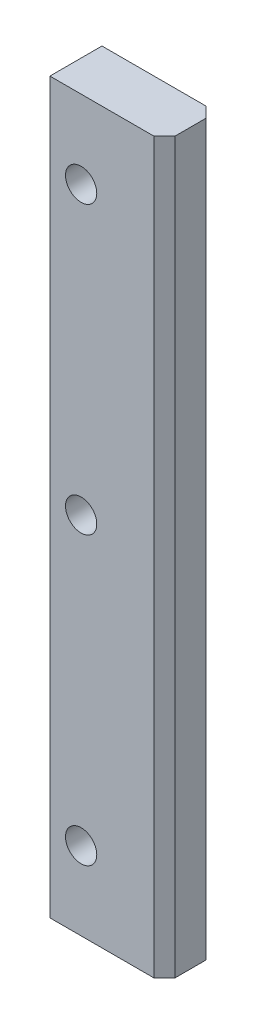
ISO-10303-21;
HEADER;
FILE_DESCRIPTION(('STEP AP214'),'2;1');
FILE_NAME('part.step','',(''),(''),'','','');
FILE_SCHEMA(('AUTOMOTIVE_DESIGN { 1 0 10303 214 1 1 1 1 }'));
ENDSEC;
DATA;
#1=APPLICATION_CONTEXT('core data for automotive mechanical design processes');
#2=APPLICATION_PROTOCOL_DEFINITION('international standard','automotive_design',2000,#1);
#3=PRODUCT_CONTEXT('',#1,'mechanical');
#4=PRODUCT('Part','Part','',(#3));
#5=PRODUCT_RELATED_PRODUCT_CATEGORY('part','',(#4));
#6=PRODUCT_DEFINITION_FORMATION('','',#4);
#7=PRODUCT_DEFINITION_CONTEXT('part definition',#1,'design');
#8=PRODUCT_DEFINITION('design','',#6,#7);
#9=PRODUCT_DEFINITION_SHAPE('','',#8);
#10=(LENGTH_UNIT() NAMED_UNIT(*) SI_UNIT(.MILLI.,.METRE.));
#11=(NAMED_UNIT(*) PLANE_ANGLE_UNIT() SI_UNIT($,.RADIAN.));
#12=(NAMED_UNIT(*) SI_UNIT($,.STERADIAN.) SOLID_ANGLE_UNIT());
#13=UNCERTAINTY_MEASURE_WITH_UNIT(LENGTH_MEASURE(1.E-05),#10,'distance_accuracy_value','');
#14=(GEOMETRIC_REPRESENTATION_CONTEXT(3) GLOBAL_UNCERTAINTY_ASSIGNED_CONTEXT((#13)) GLOBAL_UNIT_ASSIGNED_CONTEXT((#10,
#11,#12)) REPRESENTATION_CONTEXT('',''));
#15=CARTESIAN_POINT('',(0.,0.,0.));
#16=DIRECTION('',(0.,0.,1.));
#17=DIRECTION('',(1.,0.,0.));
#18=AXIS2_PLACEMENT_3D('',#15,#16,#17);
#19=CARTESIAN_POINT('',(11.,-70.,10.));
#20=DIRECTION('',(0.,1.,0.));
#21=DIRECTION('',(0.,0.,1.));
#22=AXIS2_PLACEMENT_3D('',#19,#20,#21);
#23=PLANE('',#22);
#24=DIRECTION('',(0.,0.,-1.));
#25=VECTOR('',#24,1.);
#26=CARTESIAN_POINT('',(11.,-70.,10.));
#27=LINE('',#26,#25);
#28=CARTESIAN_POINT('',(11.,-70.,8.00000000000001));
#29=VERTEX_POINT('',#28);
#30=CARTESIAN_POINT('',(11.,-70.,2.00000000000002));
#31=VERTEX_POINT('',#30);
#32=EDGE_CURVE('E131',#29,#31,#27,.T.);
#33=ORIENTED_EDGE('',*,*,#32,.F.);
#34=DIRECTION('',(0.707106781186548,0.,-0.707106781186548));
#35=VECTOR('',#34,1.);
#36=CARTESIAN_POINT('',(9.00000000000005,-70.,10.));
#37=LINE('',#36,#35);
#38=CARTESIAN_POINT('',(9.00000000000006,-70.,10.));
#39=VERTEX_POINT('',#38);
#40=EDGE_CURVE('E49',#29,#39,#37,.F.);
#41=ORIENTED_EDGE('',*,*,#40,.T.);
#42=DIRECTION('',(1.,0.,0.));
#43=VECTOR('',#42,1.);
#44=CARTESIAN_POINT('',(11.,-70.,10.));
#45=LINE('',#44,#43);
#46=CARTESIAN_POINT('',(-11.,-70.,10.));
#47=VERTEX_POINT('',#46);
#48=EDGE_CURVE('E105',#47,#39,#45,.T.);
#49=ORIENTED_EDGE('',*,*,#48,.F.);
#50=DIRECTION('',(0.,0.,-1.));
#51=VECTOR('',#50,1.);
#52=CARTESIAN_POINT('',(-11.,-70.,10.));
#53=LINE('',#52,#51);
#54=CARTESIAN_POINT('',(-11.,-70.,0.));
#55=VERTEX_POINT('',#54);
#56=EDGE_CURVE('E114',#47,#55,#53,.T.);
#57=ORIENTED_EDGE('',*,*,#56,.T.);
#58=DIRECTION('',(1.,0.,0.));
#59=VECTOR('',#58,1.);
#60=CARTESIAN_POINT('',(11.,-70.,0.));
#61=LINE('',#60,#59);
#62=CARTESIAN_POINT('',(9.00000000000003,-70.,0.));
#63=VERTEX_POINT('',#62);
#64=EDGE_CURVE('E123',#55,#63,#61,.T.);
#65=ORIENTED_EDGE('',*,*,#64,.T.);
#66=DIRECTION('',(0.707106781186548,0.,0.707106781186548));
#67=VECTOR('',#66,1.);
#68=CARTESIAN_POINT('',(11.,-70.,2.));
#69=LINE('',#68,#67);
#70=EDGE_CURVE('E61',#63,#31,#69,.T.);
#71=ORIENTED_EDGE('',*,*,#70,.T.);
#72=EDGE_LOOP('',(#33,#41,#49,#57,#65,#71));
#73=FACE_BOUND('',#72,.T.);
#74=ADVANCED_FACE('F40',(#73),#23,.F.);
#75=CARTESIAN_POINT('',(11.,70.,10.));
#76=DIRECTION('',(-1.,0.,0.));
#77=DIRECTION('',(0.,-1.,0.));
#78=AXIS2_PLACEMENT_3D('',#75,#76,#77);
#79=PLANE('',#78);
#80=DIRECTION('',(0.,0.,-1.));
#81=VECTOR('',#80,1.);
#82=CARTESIAN_POINT('',(11.,70.,10.));
#83=LINE('',#82,#81);
#84=CARTESIAN_POINT('',(11.,70.,8.00000000000001));
#85=VERTEX_POINT('',#84);
#86=CARTESIAN_POINT('',(11.,70.,2.00000000000002));
#87=VERTEX_POINT('',#86);
#88=EDGE_CURVE('E113',#85,#87,#83,.T.);
#89=ORIENTED_EDGE('',*,*,#88,.F.);
#90=DIRECTION('',(0.,-1.,0.));
#91=VECTOR('',#90,1.);
#92=CARTESIAN_POINT('',(11.,70.,8.00000000000001));
#93=LINE('',#92,#91);
#94=EDGE_CURVE('E141',#85,#29,#93,.T.);
#95=ORIENTED_EDGE('',*,*,#94,.T.);
#96=ORIENTED_EDGE('',*,*,#32,.T.);
#97=DIRECTION('',(0.,1.,0.));
#98=VECTOR('',#97,1.);
#99=CARTESIAN_POINT('',(11.,70.,2.00000000000002));
#100=LINE('',#99,#98);
#101=EDGE_CURVE('E138',#31,#87,#100,.T.);
#102=ORIENTED_EDGE('',*,*,#101,.T.);
#103=EDGE_LOOP('',(#89,#95,#96,#102));
#104=FACE_BOUND('',#103,.T.);
#105=ADVANCED_FACE('F149',(#104),#79,.F.);
#106=CARTESIAN_POINT('',(-11.,70.,10.));
#107=DIRECTION('',(0.,-1.,0.));
#108=DIRECTION('',(0.,0.,-1.));
#109=AXIS2_PLACEMENT_3D('',#106,#107,#108);
#110=PLANE('',#109);
#111=DIRECTION('',(-1.,0.,0.));
#112=VECTOR('',#111,1.);
#113=CARTESIAN_POINT('',(-11.,70.,10.));
#114=LINE('',#113,#112);
#115=CARTESIAN_POINT('',(9.00000000000002,70.,10.));
#116=VERTEX_POINT('',#115);
#117=CARTESIAN_POINT('',(-11.,70.,10.));
#118=VERTEX_POINT('',#117);
#119=EDGE_CURVE('E95',#116,#118,#114,.T.);
#120=ORIENTED_EDGE('',*,*,#119,.F.);
#121=DIRECTION('',(-0.707106781186548,0.,0.707106781186548));
#122=VECTOR('',#121,1.);
#123=CARTESIAN_POINT('',(9.00000000000003,70.,9.99999999999999));
#124=LINE('',#123,#122);
#125=EDGE_CURVE('E136',#116,#85,#124,.F.);
#126=ORIENTED_EDGE('',*,*,#125,.T.);
#127=ORIENTED_EDGE('',*,*,#88,.T.);
#128=DIRECTION('',(-0.707106781186548,0.,-0.707106781186548));
#129=VECTOR('',#128,1.);
#130=CARTESIAN_POINT('',(11.,70.,2.00000000000002));
#131=LINE('',#130,#129);
#132=CARTESIAN_POINT('',(9.,70.,0.));
#133=VERTEX_POINT('',#132);
#134=EDGE_CURVE('E134',#87,#133,#131,.T.);
#135=ORIENTED_EDGE('',*,*,#134,.T.);
#136=DIRECTION('',(-1.,0.,0.));
#137=VECTOR('',#136,1.);
#138=CARTESIAN_POINT('',(-11.,70.,0.));
#139=LINE('',#138,#137);
#140=CARTESIAN_POINT('',(-11.,70.,0.));
#141=VERTEX_POINT('',#140);
#142=EDGE_CURVE('E110',#133,#141,#139,.T.);
#143=ORIENTED_EDGE('',*,*,#142,.T.);
#144=DIRECTION('',(0.,0.,-1.));
#145=VECTOR('',#144,1.);
#146=CARTESIAN_POINT('',(-11.,70.,10.));
#147=LINE('',#146,#145);
#148=EDGE_CURVE('E108',#118,#141,#147,.T.);
#149=ORIENTED_EDGE('',*,*,#148,.F.);
#150=EDGE_LOOP('',(#120,#126,#127,#135,#143,#149));
#151=FACE_BOUND('',#150,.T.);
#152=ADVANCED_FACE('F109',(#151),#110,.F.);
#153=CARTESIAN_POINT('',(-11.,-70.,10.));
#154=DIRECTION('',(1.,0.,0.));
#155=DIRECTION('',(0.,0.,-1.));
#156=AXIS2_PLACEMENT_3D('',#153,#154,#155);
#157=PLANE('',#156);
#158=DIRECTION('',(0.,-1.,0.));
#159=VECTOR('',#158,1.);
#160=CARTESIAN_POINT('',(-11.,-70.,0.));
#161=LINE('',#160,#159);
#162=EDGE_CURVE('E127',#141,#55,#161,.T.);
#163=ORIENTED_EDGE('',*,*,#162,.T.);
#164=ORIENTED_EDGE('',*,*,#56,.F.);
#165=DIRECTION('',(0.,-1.,0.));
#166=VECTOR('',#165,1.);
#167=CARTESIAN_POINT('',(-11.,-70.,10.));
#168=LINE('',#167,#166);
#169=EDGE_CURVE('E100',#118,#47,#168,.T.);
#170=ORIENTED_EDGE('',*,*,#169,.F.);
#171=ORIENTED_EDGE('',*,*,#148,.T.);
#172=EDGE_LOOP('',(#163,#164,#170,#171));
#173=FACE_BOUND('',#172,.T.);
#174=ADVANCED_FACE('F116',(#173),#157,.F.);
#175=CARTESIAN_POINT('',(0.,0.,10.));
#176=DIRECTION('',(0.,0.,-1.));
#177=DIRECTION('',(-1.,0.,0.));
#178=AXIS2_PLACEMENT_3D('',#175,#176,#177);
#179=PLANE('',#178);
#180=CARTESIAN_POINT('',(-4.99999999999994,55.,10.));
#181=DIRECTION('',(0.,0.,1.));
#182=DIRECTION('',(1.,0.,0.));
#183=AXIS2_PLACEMENT_3D('',#180,#181,#182);
#184=CIRCLE('',#183,3.);
#185=CARTESIAN_POINT('',(-1.99999999999993,55.,10.));
#186=VERTEX_POINT('',#185);
#187=EDGE_CURVE('E235',#186,#186,#184,.T.);
#188=ORIENTED_EDGE('',*,*,#187,.F.);
#189=EDGE_LOOP('',(#188));
#190=FACE_BOUND('',#189,.T.);
#191=CARTESIAN_POINT('',(-4.99999999999993,0.,10.));
#192=DIRECTION('',(0.,0.,1.));
#193=DIRECTION('',(1.,0.,0.));
#194=AXIS2_PLACEMENT_3D('',#191,#192,#193);
#195=CIRCLE('',#194,3.);
#196=CARTESIAN_POINT('',(-1.99999999999993,0.,10.));
#197=VERTEX_POINT('',#196);
#198=EDGE_CURVE('E240',#197,#197,#195,.T.);
#199=ORIENTED_EDGE('',*,*,#198,.F.);
#200=EDGE_LOOP('',(#199));
#201=FACE_BOUND('',#200,.T.);
#202=CARTESIAN_POINT('',(-4.9999999999999,-55.,10.));
#203=DIRECTION('',(0.,0.,1.));
#204=DIRECTION('',(1.,0.,0.));
#205=AXIS2_PLACEMENT_3D('',#202,#203,#204);
#206=CIRCLE('',#205,3.);
#207=CARTESIAN_POINT('',(-1.9999999999999,-55.,10.));
#208=VERTEX_POINT('',#207);
#209=EDGE_CURVE('E248',#208,#208,#206,.T.);
#210=ORIENTED_EDGE('',*,*,#209,.F.);
#211=EDGE_LOOP('',(#210));
#212=FACE_BOUND('',#211,.T.);
#213=ORIENTED_EDGE('',*,*,#48,.T.);
#214=DIRECTION('',(0.,1.,0.));
#215=VECTOR('',#214,1.);
#216=CARTESIAN_POINT('',(9.00000000000004,0.,10.));
#217=LINE('',#216,#215);
#218=EDGE_CURVE('E103',#39,#116,#217,.T.);
#219=ORIENTED_EDGE('',*,*,#218,.T.);
#220=ORIENTED_EDGE('',*,*,#119,.T.);
#221=ORIENTED_EDGE('',*,*,#169,.T.);
#222=EDGE_LOOP('',(#213,#219,#220,#221));
#223=FACE_BOUND('',#222,.T.);
#224=ADVANCED_FACE('F98',(#190,#201,#212,#223),#179,.F.);
#225=CARTESIAN_POINT('',(0.,0.,0.));
#226=DIRECTION('',(0.,0.,-1.));
#227=DIRECTION('',(-1.,0.,0.));
#228=AXIS2_PLACEMENT_3D('',#225,#226,#227);
#229=PLANE('',#228);
#230=CARTESIAN_POINT('',(-4.99999999999994,55.,0.));
#231=DIRECTION('',(0.,0.,1.));
#232=DIRECTION('',(1.,0.,0.));
#233=AXIS2_PLACEMENT_3D('',#230,#231,#232);
#234=CIRCLE('',#233,3.);
#235=CARTESIAN_POINT('',(-1.99999999999993,55.,0.));
#236=VERTEX_POINT('',#235);
#237=EDGE_CURVE('E125',#236,#236,#234,.T.);
#238=ORIENTED_EDGE('',*,*,#237,.T.);
#239=EDGE_LOOP('',(#238));
#240=FACE_BOUND('',#239,.T.);
#241=CARTESIAN_POINT('',(-4.99999999999993,0.,0.));
#242=DIRECTION('',(0.,0.,1.));
#243=DIRECTION('',(1.,0.,0.));
#244=AXIS2_PLACEMENT_3D('',#241,#242,#243);
#245=CIRCLE('',#244,3.);
#246=CARTESIAN_POINT('',(-1.99999999999993,0.,0.));
#247=VERTEX_POINT('',#246);
#248=EDGE_CURVE('E236',#247,#247,#245,.T.);
#249=ORIENTED_EDGE('',*,*,#248,.T.);
#250=EDGE_LOOP('',(#249));
#251=FACE_BOUND('',#250,.T.);
#252=CARTESIAN_POINT('',(-4.9999999999999,-55.,0.));
#253=DIRECTION('',(0.,0.,1.));
#254=DIRECTION('',(1.,0.,0.));
#255=AXIS2_PLACEMENT_3D('',#252,#253,#254);
#256=CIRCLE('',#255,3.);
#257=CARTESIAN_POINT('',(-1.9999999999999,-55.,0.));
#258=VERTEX_POINT('',#257);
#259=EDGE_CURVE('E245',#258,#258,#256,.T.);
#260=ORIENTED_EDGE('',*,*,#259,.T.);
#261=EDGE_LOOP('',(#260));
#262=FACE_BOUND('',#261,.T.);
#263=ORIENTED_EDGE('',*,*,#142,.F.);
#264=DIRECTION('',(0.,-1.,0.));
#265=VECTOR('',#264,1.);
#266=CARTESIAN_POINT('',(9.00000000000003,-70.,0.));
#267=LINE('',#266,#265);
#268=EDGE_CURVE('E11',#133,#63,#267,.T.);
#269=ORIENTED_EDGE('',*,*,#268,.T.);
#270=ORIENTED_EDGE('',*,*,#64,.F.);
#271=ORIENTED_EDGE('',*,*,#162,.F.);
#272=EDGE_LOOP('',(#263,#269,#270,#271));
#273=FACE_BOUND('',#272,.T.);
#274=ADVANCED_FACE('F152',(#240,#251,#262,#273),#229,.T.);
#275=CARTESIAN_POINT('',(9.00000000000004,0.,10.));
#276=DIRECTION('',(-0.707106781186547,0.,-0.707106781186547));
#277=DIRECTION('',(0.,1.,0.));
#278=AXIS2_PLACEMENT_3D('',#275,#276,#277);
#279=PLANE('',#278);
#280=ORIENTED_EDGE('',*,*,#40,.F.);
#281=ORIENTED_EDGE('',*,*,#94,.F.);
#282=ORIENTED_EDGE('',*,*,#125,.F.);
#283=ORIENTED_EDGE('',*,*,#218,.F.);
#284=EDGE_LOOP('',(#280,#281,#282,#283));
#285=FACE_BOUND('',#284,.T.);
#286=ADVANCED_FACE('F146',(#285),#279,.F.);
#287=CARTESIAN_POINT('',(11.,70.,2.00000000000002));
#288=DIRECTION('',(0.707106781186547,0.,-0.707106781186547));
#289=DIRECTION('',(0.,-1.,0.));
#290=AXIS2_PLACEMENT_3D('',#287,#288,#289);
#291=PLANE('',#290);
#292=ORIENTED_EDGE('',*,*,#70,.F.);
#293=ORIENTED_EDGE('',*,*,#268,.F.);
#294=ORIENTED_EDGE('',*,*,#134,.F.);
#295=ORIENTED_EDGE('',*,*,#101,.F.);
#296=EDGE_LOOP('',(#292,#293,#294,#295));
#297=FACE_BOUND('',#296,.T.);
#298=ADVANCED_FACE('F43',(#297),#291,.T.);
#299=CARTESIAN_POINT('',(-4.9999999999999,-55.,0.));
#300=DIRECTION('',(0.,0.,1.));
#301=DIRECTION('',(1.,0.,0.));
#302=AXIS2_PLACEMENT_3D('',#299,#300,#301);
#303=CYLINDRICAL_SURFACE('',#302,3.);
#304=ORIENTED_EDGE('',*,*,#259,.F.);
#305=EDGE_LOOP('',(#304));
#306=FACE_BOUND('',#305,.T.);
#307=ORIENTED_EDGE('',*,*,#209,.T.);
#308=EDGE_LOOP('',(#307));
#309=FACE_BOUND('',#308,.T.);
#310=ADVANCED_FACE('F202',(#306,#309),#303,.F.);
#311=CARTESIAN_POINT('',(-4.99999999999993,0.,0.));
#312=DIRECTION('',(0.,0.,1.));
#313=DIRECTION('',(1.,0.,0.));
#314=AXIS2_PLACEMENT_3D('',#311,#312,#313);
#315=CYLINDRICAL_SURFACE('',#314,3.);
#316=ORIENTED_EDGE('',*,*,#248,.F.);
#317=EDGE_LOOP('',(#316));
#318=FACE_BOUND('',#317,.T.);
#319=ORIENTED_EDGE('',*,*,#198,.T.);
#320=EDGE_LOOP('',(#319));
#321=FACE_BOUND('',#320,.T.);
#322=ADVANCED_FACE('F207',(#318,#321),#315,.F.);
#323=CARTESIAN_POINT('',(-4.99999999999994,55.,0.));
#324=DIRECTION('',(0.,0.,1.));
#325=DIRECTION('',(1.,0.,0.));
#326=AXIS2_PLACEMENT_3D('',#323,#324,#325);
#327=CYLINDRICAL_SURFACE('',#326,3.);
#328=ORIENTED_EDGE('',*,*,#237,.F.);
#329=EDGE_LOOP('',(#328));
#330=FACE_BOUND('',#329,.T.);
#331=ORIENTED_EDGE('',*,*,#187,.T.);
#332=EDGE_LOOP('',(#331));
#333=FACE_BOUND('',#332,.T.);
#334=ADVANCED_FACE('F217',(#330,#333),#327,.F.);
#335=CLOSED_SHELL('',(#74,#105,#152,#174,#224,#274,#286,#298,#310,#322,#334));
#336=MANIFOLD_SOLID_BREP('B2',#335);
#337=ADVANCED_BREP_SHAPE_REPRESENTATION('',(#18,#336),#14);
#338=SHAPE_DEFINITION_REPRESENTATION(#9,#337);
ENDSEC;
END-ISO-10303-21;
